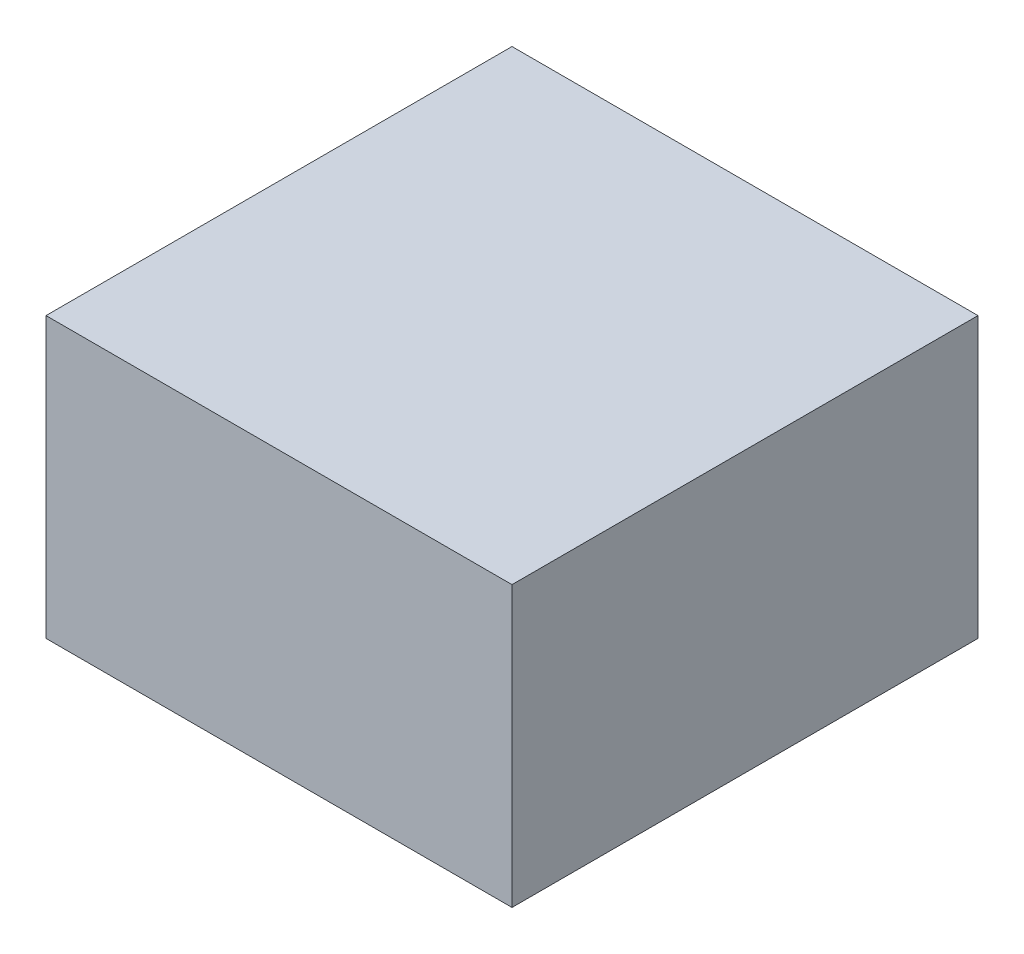
ISO-10303-21;
HEADER;
FILE_DESCRIPTION(('STEP AP214'),'2;1');
FILE_NAME('part.step','',(''),(''),'','','');
FILE_SCHEMA(('AUTOMOTIVE_DESIGN { 1 0 10303 214 1 1 1 1 }'));
ENDSEC;
DATA;
#1=APPLICATION_CONTEXT('core data for automotive mechanical design processes');
#2=APPLICATION_PROTOCOL_DEFINITION('international standard','automotive_design',2000,#1);
#3=PRODUCT_CONTEXT('',#1,'mechanical');
#4=PRODUCT('Part','Part','',(#3));
#5=PRODUCT_RELATED_PRODUCT_CATEGORY('part','',(#4));
#6=PRODUCT_DEFINITION_FORMATION('','',#4);
#7=PRODUCT_DEFINITION_CONTEXT('part definition',#1,'design');
#8=PRODUCT_DEFINITION('design','',#6,#7);
#9=PRODUCT_DEFINITION_SHAPE('','',#8);
#10=(LENGTH_UNIT() NAMED_UNIT(*) SI_UNIT(.MILLI.,.METRE.));
#11=(NAMED_UNIT(*) PLANE_ANGLE_UNIT() SI_UNIT($,.RADIAN.));
#12=(NAMED_UNIT(*) SI_UNIT($,.STERADIAN.) SOLID_ANGLE_UNIT());
#13=UNCERTAINTY_MEASURE_WITH_UNIT(LENGTH_MEASURE(1.E-05),#10,'distance_accuracy_value','');
#14=(GEOMETRIC_REPRESENTATION_CONTEXT(3) GLOBAL_UNCERTAINTY_ASSIGNED_CONTEXT((#13)) GLOBAL_UNIT_ASSIGNED_CONTEXT((#10,
#11,#12)) REPRESENTATION_CONTEXT('',''));
#15=CARTESIAN_POINT('',(0.,0.,0.));
#16=DIRECTION('',(0.,0.,1.));
#17=DIRECTION('',(1.,0.,0.));
#18=AXIS2_PLACEMENT_3D('',#15,#16,#17);
#19=CARTESIAN_POINT('',(25.,-15.,25.));
#20=DIRECTION('',(-1.,0.,0.));
#21=DIRECTION('',(0.,0.,1.));
#22=AXIS2_PLACEMENT_3D('',#19,#20,#21);
#23=PLANE('',#22);
#24=DIRECTION('',(0.,1.,0.));
#25=VECTOR('',#24,1.);
#26=CARTESIAN_POINT('',(25.,-15.,-25.));
#27=LINE('',#26,#25);
#28=CARTESIAN_POINT('',(25.,-15.,-25.));
#29=VERTEX_POINT('',#28);
#30=CARTESIAN_POINT('',(25.,15.,-25.));
#31=VERTEX_POINT('',#30);
#32=EDGE_CURVE('E99',#29,#31,#27,.T.);
#33=ORIENTED_EDGE('',*,*,#32,.T.);
#34=DIRECTION('',(0.,0.,-1.));
#35=VECTOR('',#34,1.);
#36=CARTESIAN_POINT('',(25.,15.,25.));
#37=LINE('',#36,#35);
#38=CARTESIAN_POINT('',(25.,15.,25.));
#39=VERTEX_POINT('',#38);
#40=EDGE_CURVE('E11',#39,#31,#37,.T.);
#41=ORIENTED_EDGE('',*,*,#40,.F.);
#42=DIRECTION('',(0.,1.,0.));
#43=VECTOR('',#42,1.);
#44=CARTESIAN_POINT('',(25.,-15.,25.));
#45=LINE('',#44,#43);
#46=CARTESIAN_POINT('',(25.,-15.,25.));
#47=VERTEX_POINT('',#46);
#48=EDGE_CURVE('E87',#47,#39,#45,.T.);
#49=ORIENTED_EDGE('',*,*,#48,.F.);
#50=DIRECTION('',(0.,0.,-1.));
#51=VECTOR('',#50,1.);
#52=CARTESIAN_POINT('',(25.,-15.,25.));
#53=LINE('',#52,#51);
#54=EDGE_CURVE('E95',#47,#29,#53,.T.);
#55=ORIENTED_EDGE('',*,*,#54,.T.);
#56=EDGE_LOOP('',(#33,#41,#49,#55));
#57=FACE_BOUND('',#56,.T.);
#58=ADVANCED_FACE('F36',(#57),#23,.F.);
#59=CARTESIAN_POINT('',(-25.,15.,25.));
#60=DIRECTION('',(0.,-1.,0.));
#61=DIRECTION('',(0.,0.,-1.));
#62=AXIS2_PLACEMENT_3D('',#59,#60,#61);
#63=PLANE('',#62);
#64=DIRECTION('',(-1.,0.,0.));
#65=VECTOR('',#64,1.);
#66=CARTESIAN_POINT('',(-25.,15.,-25.));
#67=LINE('',#66,#65);
#68=CARTESIAN_POINT('',(-25.,15.,-25.));
#69=VERTEX_POINT('',#68);
#70=EDGE_CURVE('E91',#31,#69,#67,.T.);
#71=ORIENTED_EDGE('',*,*,#70,.T.);
#72=DIRECTION('',(0.,0.,-1.));
#73=VECTOR('',#72,1.);
#74=CARTESIAN_POINT('',(-25.,15.,25.));
#75=LINE('',#74,#73);
#76=CARTESIAN_POINT('',(-25.,15.,25.));
#77=VERTEX_POINT('',#76);
#78=EDGE_CURVE('E44',#77,#69,#75,.T.);
#79=ORIENTED_EDGE('',*,*,#78,.F.);
#80=DIRECTION('',(-1.,0.,0.));
#81=VECTOR('',#80,1.);
#82=CARTESIAN_POINT('',(-25.,15.,25.));
#83=LINE('',#82,#81);
#84=EDGE_CURVE('E82',#39,#77,#83,.T.);
#85=ORIENTED_EDGE('',*,*,#84,.F.);
#86=ORIENTED_EDGE('',*,*,#40,.T.);
#87=EDGE_LOOP('',(#71,#79,#85,#86));
#88=FACE_BOUND('',#87,.T.);
#89=ADVANCED_FACE('F90',(#88),#63,.F.);
#90=CARTESIAN_POINT('',(-25.,-15.,25.));
#91=DIRECTION('',(1.,0.,0.));
#92=DIRECTION('',(0.,0.,-1.));
#93=AXIS2_PLACEMENT_3D('',#90,#91,#92);
#94=PLANE('',#93);
#95=DIRECTION('',(0.,-1.,0.));
#96=VECTOR('',#95,1.);
#97=CARTESIAN_POINT('',(-25.,-15.,-25.));
#98=LINE('',#97,#96);
#99=CARTESIAN_POINT('',(-25.,-15.,-25.));
#100=VERTEX_POINT('',#99);
#101=EDGE_CURVE('E69',#69,#100,#98,.T.);
#102=ORIENTED_EDGE('',*,*,#101,.T.);
#103=DIRECTION('',(0.,0.,-1.));
#104=VECTOR('',#103,1.);
#105=CARTESIAN_POINT('',(-25.,-15.,25.));
#106=LINE('',#105,#104);
#107=CARTESIAN_POINT('',(-25.,-15.,25.));
#108=VERTEX_POINT('',#107);
#109=EDGE_CURVE('E92',#108,#100,#106,.T.);
#110=ORIENTED_EDGE('',*,*,#109,.F.);
#111=DIRECTION('',(0.,-1.,0.));
#112=VECTOR('',#111,1.);
#113=CARTESIAN_POINT('',(-25.,-15.,25.));
#114=LINE('',#113,#112);
#115=EDGE_CURVE('E85',#77,#108,#114,.T.);
#116=ORIENTED_EDGE('',*,*,#115,.F.);
#117=ORIENTED_EDGE('',*,*,#78,.T.);
#118=EDGE_LOOP('',(#102,#110,#116,#117));
#119=FACE_BOUND('',#118,.T.);
#120=ADVANCED_FACE('F93',(#119),#94,.F.);
#121=CARTESIAN_POINT('',(-25.,-15.,25.));
#122=DIRECTION('',(0.,1.,0.));
#123=DIRECTION('',(0.,0.,1.));
#124=AXIS2_PLACEMENT_3D('',#121,#122,#123);
#125=PLANE('',#124);
#126=DIRECTION('',(1.,0.,0.));
#127=VECTOR('',#126,1.);
#128=CARTESIAN_POINT('',(-25.,-15.,-25.));
#129=LINE('',#128,#127);
#130=EDGE_CURVE('E75',#100,#29,#129,.T.);
#131=ORIENTED_EDGE('',*,*,#130,.T.);
#132=ORIENTED_EDGE('',*,*,#54,.F.);
#133=DIRECTION('',(1.,0.,0.));
#134=VECTOR('',#133,1.);
#135=CARTESIAN_POINT('',(-25.,-15.,25.));
#136=LINE('',#135,#134);
#137=EDGE_CURVE('E52',#108,#47,#136,.T.);
#138=ORIENTED_EDGE('',*,*,#137,.F.);
#139=ORIENTED_EDGE('',*,*,#109,.T.);
#140=EDGE_LOOP('',(#131,#132,#138,#139));
#141=FACE_BOUND('',#140,.T.);
#142=ADVANCED_FACE('F106',(#141),#125,.F.);
#143=CARTESIAN_POINT('',(0.,0.,25.));
#144=DIRECTION('',(0.,0.,-1.));
#145=DIRECTION('',(-1.,0.,0.));
#146=AXIS2_PLACEMENT_3D('',#143,#144,#145);
#147=PLANE('',#146);
#148=ORIENTED_EDGE('',*,*,#48,.T.);
#149=ORIENTED_EDGE('',*,*,#84,.T.);
#150=ORIENTED_EDGE('',*,*,#115,.T.);
#151=ORIENTED_EDGE('',*,*,#137,.T.);
#152=EDGE_LOOP('',(#148,#149,#150,#151));
#153=FACE_BOUND('',#152,.T.);
#154=ADVANCED_FACE('F83',(#153),#147,.F.);
#155=CARTESIAN_POINT('',(0.,0.,-25.));
#156=DIRECTION('',(0.,0.,-1.));
#157=DIRECTION('',(-1.,0.,0.));
#158=AXIS2_PLACEMENT_3D('',#155,#156,#157);
#159=PLANE('',#158);
#160=ORIENTED_EDGE('',*,*,#32,.F.);
#161=ORIENTED_EDGE('',*,*,#130,.F.);
#162=ORIENTED_EDGE('',*,*,#101,.F.);
#163=ORIENTED_EDGE('',*,*,#70,.F.);
#164=EDGE_LOOP('',(#160,#161,#162,#163));
#165=FACE_BOUND('',#164,.T.);
#166=ADVANCED_FACE('F109',(#165),#159,.T.);
#167=CLOSED_SHELL('',(#58,#89,#120,#142,#154,#166));
#168=MANIFOLD_SOLID_BREP('B2',#167);
#169=ADVANCED_BREP_SHAPE_REPRESENTATION('',(#18,#168),#14);
#170=SHAPE_DEFINITION_REPRESENTATION(#9,#169);
ENDSEC;
END-ISO-10303-21;
